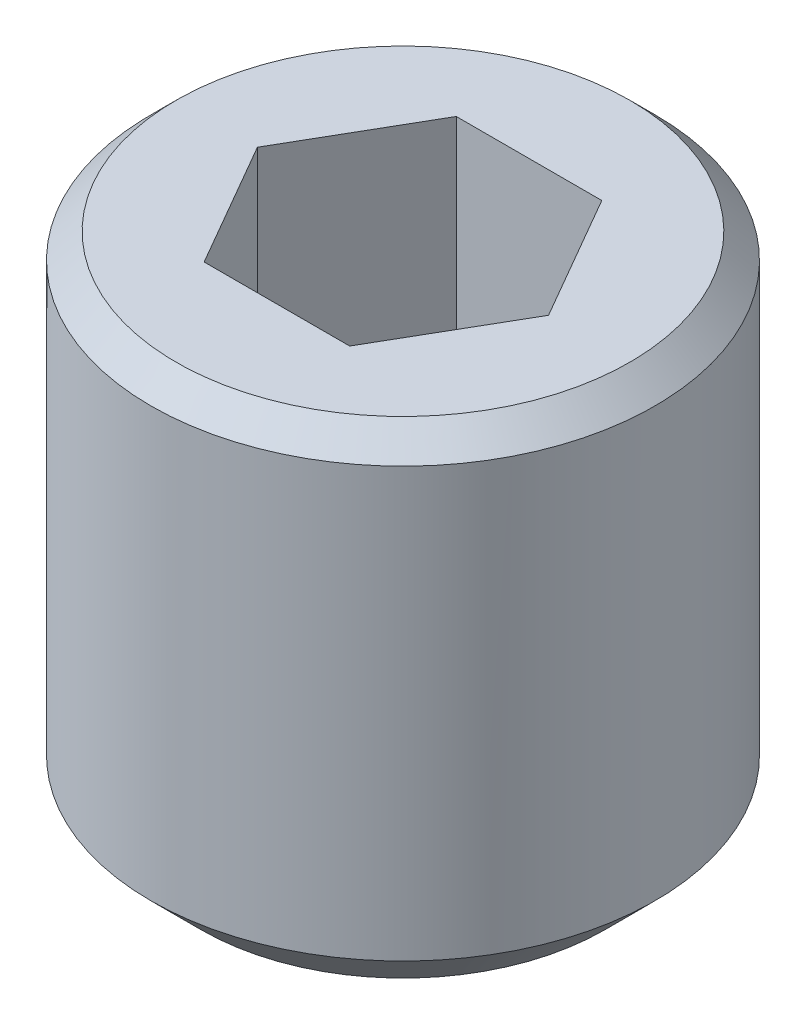
ISO-10303-21;
HEADER;
FILE_DESCRIPTION(('STEP AP214'),'2;1');
FILE_NAME('part.step','',(''),(''),'','','');
FILE_SCHEMA(('AUTOMOTIVE_DESIGN { 1 0 10303 214 1 1 1 1 }'));
ENDSEC;
DATA;
#1=APPLICATION_CONTEXT('core data for automotive mechanical design processes');
#2=APPLICATION_PROTOCOL_DEFINITION('international standard','automotive_design',2000,#1);
#3=PRODUCT_CONTEXT('',#1,'mechanical');
#4=PRODUCT('Part','Part','',(#3));
#5=PRODUCT_RELATED_PRODUCT_CATEGORY('part','',(#4));
#6=PRODUCT_DEFINITION_FORMATION('','',#4);
#7=PRODUCT_DEFINITION_CONTEXT('part definition',#1,'design');
#8=PRODUCT_DEFINITION('design','',#6,#7);
#9=PRODUCT_DEFINITION_SHAPE('','',#8);
#10=(LENGTH_UNIT() NAMED_UNIT(*) SI_UNIT(.MILLI.,.METRE.));
#11=(NAMED_UNIT(*) PLANE_ANGLE_UNIT() SI_UNIT($,.RADIAN.));
#12=(NAMED_UNIT(*) SI_UNIT($,.STERADIAN.) SOLID_ANGLE_UNIT());
#13=UNCERTAINTY_MEASURE_WITH_UNIT(LENGTH_MEASURE(1.E-05),#10,'distance_accuracy_value','');
#14=(GEOMETRIC_REPRESENTATION_CONTEXT(3) GLOBAL_UNCERTAINTY_ASSIGNED_CONTEXT((#13)) GLOBAL_UNIT_ASSIGNED_CONTEXT((#10,
#11,#12)) REPRESENTATION_CONTEXT('',''));
#15=CARTESIAN_POINT('',(0.,0.,0.));
#16=DIRECTION('',(0.,0.,1.));
#17=DIRECTION('',(1.,0.,0.));
#18=AXIS2_PLACEMENT_3D('',#15,#16,#17);
#19=CARTESIAN_POINT('',(0.,0.,0.));
#20=DIRECTION('',(0.,-1.,0.));
#21=DIRECTION('',(0.,0.,-1.));
#22=AXIS2_PLACEMENT_3D('',#19,#20,#21);
#23=PLANE('',#22);
#24=CARTESIAN_POINT('',(0.,0.,0.));
#25=DIRECTION('',(0.,-1.,0.));
#26=DIRECTION('',(0.,0.,-1.));
#27=AXIS2_PLACEMENT_3D('',#24,#25,#26);
#28=CIRCLE('',#27,1.35);
#29=CARTESIAN_POINT('',(0.,0.,-1.35));
#30=VERTEX_POINT('',#29);
#31=EDGE_CURVE('E44',#30,#30,#28,.F.);
#32=ORIENTED_EDGE('',*,*,#31,.T.);
#33=EDGE_LOOP('',(#32));
#34=FACE_BOUND('',#33,.T.);
#35=DIRECTION('',(-0.5,0.,0.866025403784439));
#36=VECTOR('',#35,1.);
#37=CARTESIAN_POINT('',(-0.43301270189222,0.,-0.75));
#38=LINE('',#37,#36);
#39=CARTESIAN_POINT('',(-0.43301270189222,0.,-0.75));
#40=VERTEX_POINT('',#39);
#41=CARTESIAN_POINT('',(-0.866025403784439,0.,0.));
#42=VERTEX_POINT('',#41);
#43=EDGE_CURVE('E125',#40,#42,#38,.T.);
#44=ORIENTED_EDGE('',*,*,#43,.F.);
#45=DIRECTION('',(-1.,0.,0.));
#46=VECTOR('',#45,1.);
#47=CARTESIAN_POINT('',(0.43301270189222,0.,-0.75));
#48=LINE('',#47,#46);
#49=CARTESIAN_POINT('',(0.43301270189222,0.,-0.75));
#50=VERTEX_POINT('',#49);
#51=EDGE_CURVE('E51',#50,#40,#48,.T.);
#52=ORIENTED_EDGE('',*,*,#51,.F.);
#53=DIRECTION('',(-0.5,0.,-0.866025403784439));
#54=VECTOR('',#53,1.);
#55=CARTESIAN_POINT('',(0.866025403784439,0.,0.));
#56=LINE('',#55,#54);
#57=CARTESIAN_POINT('',(0.866025403784439,0.,0.));
#58=VERTEX_POINT('',#57);
#59=EDGE_CURVE('E134',#58,#50,#56,.T.);
#60=ORIENTED_EDGE('',*,*,#59,.F.);
#61=DIRECTION('',(0.5,0.,-0.866025403784439));
#62=VECTOR('',#61,1.);
#63=CARTESIAN_POINT('',(0.43301270189222,0.,0.75));
#64=LINE('',#63,#62);
#65=CARTESIAN_POINT('',(0.43301270189222,0.,0.75));
#66=VERTEX_POINT('',#65);
#67=EDGE_CURVE('E132',#66,#58,#64,.T.);
#68=ORIENTED_EDGE('',*,*,#67,.F.);
#69=DIRECTION('',(1.,0.,0.));
#70=VECTOR('',#69,1.);
#71=CARTESIAN_POINT('',(-0.433012701892219,0.,0.750000000000001));
#72=LINE('',#71,#70);
#73=CARTESIAN_POINT('',(-0.433012701892219,0.,0.750000000000001));
#74=VERTEX_POINT('',#73);
#75=EDGE_CURVE('E99',#74,#66,#72,.T.);
#76=ORIENTED_EDGE('',*,*,#75,.F.);
#77=DIRECTION('',(0.5,0.,0.866025403784438));
#78=VECTOR('',#77,1.);
#79=CARTESIAN_POINT('',(-0.866025403784439,0.,0.));
#80=LINE('',#79,#78);
#81=EDGE_CURVE('E128',#42,#74,#80,.T.);
#82=ORIENTED_EDGE('',*,*,#81,.F.);
#83=EDGE_LOOP('',(#44,#52,#60,#68,#76,#82));
#84=FACE_BOUND('',#83,.T.);
#85=ADVANCED_FACE('F36',(#34,#84),#23,.F.);
#86=CARTESIAN_POINT('',(0.,0.,0.));
#87=DIRECTION('',(0.,1.,0.));
#88=DIRECTION('',(0.,0.,1.));
#89=AXIS2_PLACEMENT_3D('',#86,#87,#88);
#90=CYLINDRICAL_SURFACE('',#89,1.5);
#91=CARTESIAN_POINT('',(0.,-0.150000000000001,0.));
#92=DIRECTION('',(0.,-1.,0.));
#93=DIRECTION('',(0.,0.,-1.));
#94=AXIS2_PLACEMENT_3D('',#91,#92,#93);
#95=CIRCLE('',#94,1.5);
#96=CARTESIAN_POINT('',(0.,-0.150000000000001,-1.5));
#97=VERTEX_POINT('',#96);
#98=EDGE_CURVE('E11',#97,#97,#95,.T.);
#99=ORIENTED_EDGE('',*,*,#98,.T.);
#100=EDGE_LOOP('',(#99));
#101=FACE_BOUND('',#100,.T.);
#102=CARTESIAN_POINT('',(0.,-2.7,0.));
#103=DIRECTION('',(0.,1.,0.));
#104=DIRECTION('',(0.,0.,1.));
#105=AXIS2_PLACEMENT_3D('',#102,#103,#104);
#106=CIRCLE('',#105,1.5);
#107=CARTESIAN_POINT('',(0.,-2.7,1.5));
#108=VERTEX_POINT('',#107);
#109=EDGE_CURVE('E138',#108,#108,#106,.T.);
#110=ORIENTED_EDGE('',*,*,#109,.T.);
#111=EDGE_LOOP('',(#110));
#112=FACE_BOUND('',#111,.T.);
#113=ADVANCED_FACE('F162',(#101,#112),#90,.T.);
#114=CARTESIAN_POINT('',(1.5,-3.,0.));
#115=DIRECTION('',(0.,1.,0.));
#116=DIRECTION('',(0.,0.,1.));
#117=AXIS2_PLACEMENT_3D('',#114,#115,#116);
#118=PLANE('',#117);
#119=CARTESIAN_POINT('',(0.,-3.,0.));
#120=DIRECTION('',(0.,1.,0.));
#121=DIRECTION('',(0.,0.,1.));
#122=AXIS2_PLACEMENT_3D('',#119,#120,#121);
#123=CIRCLE('',#122,1.2);
#124=CARTESIAN_POINT('',(0.,-3.,1.2));
#125=VERTEX_POINT('',#124);
#126=EDGE_CURVE('E146',#125,#125,#123,.F.);
#127=ORIENTED_EDGE('',*,*,#126,.T.);
#128=EDGE_LOOP('',(#127));
#129=FACE_BOUND('',#128,.T.);
#130=ADVANCED_FACE('F167',(#129),#118,.F.);
#131=CARTESIAN_POINT('',(0.43301270189222,-1.5,-0.75));
#132=DIRECTION('',(0.,0.,-1.));
#133=DIRECTION('',(-1.,0.,0.));
#134=AXIS2_PLACEMENT_3D('',#131,#132,#133);
#135=PLANE('',#134);
#136=ORIENTED_EDGE('',*,*,#51,.T.);
#137=DIRECTION('',(0.,1.,0.));
#138=VECTOR('',#137,1.);
#139=CARTESIAN_POINT('',(-0.43301270189222,-1.5,-0.75));
#140=LINE('',#139,#138);
#141=CARTESIAN_POINT('',(-0.43301270189222,-1.5,-0.75));
#142=VERTEX_POINT('',#141);
#143=EDGE_CURVE('E81',#142,#40,#140,.T.);
#144=ORIENTED_EDGE('',*,*,#143,.F.);
#145=DIRECTION('',(-1.,0.,0.));
#146=VECTOR('',#145,1.);
#147=CARTESIAN_POINT('',(0.43301270189222,-1.5,-0.75));
#148=LINE('',#147,#146);
#149=CARTESIAN_POINT('',(0.43301270189222,-1.5,-0.75));
#150=VERTEX_POINT('',#149);
#151=EDGE_CURVE('E136',#150,#142,#148,.T.);
#152=ORIENTED_EDGE('',*,*,#151,.F.);
#153=DIRECTION('',(0.,1.,0.));
#154=VECTOR('',#153,1.);
#155=CARTESIAN_POINT('',(0.43301270189222,-1.5,-0.75));
#156=LINE('',#155,#154);
#157=EDGE_CURVE('E59',#150,#50,#156,.T.);
#158=ORIENTED_EDGE('',*,*,#157,.T.);
#159=EDGE_LOOP('',(#136,#144,#152,#158));
#160=FACE_BOUND('',#159,.T.);
#161=ADVANCED_FACE('F173',(#160),#135,.F.);
#162=CARTESIAN_POINT('',(0.866025403784439,-1.5,0.));
#163=DIRECTION('',(0.866025403784439,0.,-0.5));
#164=DIRECTION('',(-0.5,0.,-0.866025403784439));
#165=AXIS2_PLACEMENT_3D('',#162,#163,#164);
#166=PLANE('',#165);
#167=ORIENTED_EDGE('',*,*,#59,.T.);
#168=ORIENTED_EDGE('',*,*,#157,.F.);
#169=DIRECTION('',(-0.5,0.,-0.866025403784439));
#170=VECTOR('',#169,1.);
#171=CARTESIAN_POINT('',(0.866025403784439,-1.5,0.));
#172=LINE('',#171,#170);
#173=CARTESIAN_POINT('',(0.866025403784439,-1.5,0.));
#174=VERTEX_POINT('',#173);
#175=EDGE_CURVE('E111',#174,#150,#172,.T.);
#176=ORIENTED_EDGE('',*,*,#175,.F.);
#177=DIRECTION('',(0.,1.,0.));
#178=VECTOR('',#177,1.);
#179=CARTESIAN_POINT('',(0.866025403784439,-1.5,0.));
#180=LINE('',#179,#178);
#181=EDGE_CURVE('E103',#174,#58,#180,.T.);
#182=ORIENTED_EDGE('',*,*,#181,.T.);
#183=EDGE_LOOP('',(#167,#168,#176,#182));
#184=FACE_BOUND('',#183,.T.);
#185=ADVANCED_FACE('F177',(#184),#166,.F.);
#186=CARTESIAN_POINT('',(0.43301270189222,-1.5,0.75));
#187=DIRECTION('',(0.866025403784439,0.,0.5));
#188=DIRECTION('',(0.5,0.,-0.866025403784439));
#189=AXIS2_PLACEMENT_3D('',#186,#187,#188);
#190=PLANE('',#189);
#191=ORIENTED_EDGE('',*,*,#67,.T.);
#192=ORIENTED_EDGE('',*,*,#181,.F.);
#193=DIRECTION('',(0.5,0.,-0.866025403784439));
#194=VECTOR('',#193,1.);
#195=CARTESIAN_POINT('',(0.43301270189222,-1.5,0.75));
#196=LINE('',#195,#194);
#197=CARTESIAN_POINT('',(0.43301270189222,-1.5,0.75));
#198=VERTEX_POINT('',#197);
#199=EDGE_CURVE('E107',#198,#174,#196,.T.);
#200=ORIENTED_EDGE('',*,*,#199,.F.);
#201=DIRECTION('',(0.,1.,0.));
#202=VECTOR('',#201,1.);
#203=CARTESIAN_POINT('',(0.43301270189222,-1.5,0.75));
#204=LINE('',#203,#202);
#205=EDGE_CURVE('E92',#198,#66,#204,.T.);
#206=ORIENTED_EDGE('',*,*,#205,.T.);
#207=EDGE_LOOP('',(#191,#192,#200,#206));
#208=FACE_BOUND('',#207,.T.);
#209=ADVANCED_FACE('F108',(#208),#190,.F.);
#210=CARTESIAN_POINT('',(-0.433012701892219,-1.5,0.750000000000001));
#211=DIRECTION('',(0.,0.,1.));
#212=DIRECTION('',(1.,0.,0.));
#213=AXIS2_PLACEMENT_3D('',#210,#211,#212);
#214=PLANE('',#213);
#215=ORIENTED_EDGE('',*,*,#75,.T.);
#216=ORIENTED_EDGE('',*,*,#205,.F.);
#217=DIRECTION('',(1.,0.,0.));
#218=VECTOR('',#217,1.);
#219=CARTESIAN_POINT('',(-0.433012701892219,-1.5,0.750000000000001));
#220=LINE('',#219,#218);
#221=CARTESIAN_POINT('',(-0.433012701892219,-1.5,0.750000000000001));
#222=VERTEX_POINT('',#221);
#223=EDGE_CURVE('E96',#222,#198,#220,.T.);
#224=ORIENTED_EDGE('',*,*,#223,.F.);
#225=DIRECTION('',(0.,1.,0.));
#226=VECTOR('',#225,1.);
#227=CARTESIAN_POINT('',(-0.433012701892219,-1.5,0.750000000000001));
#228=LINE('',#227,#226);
#229=EDGE_CURVE('E104',#222,#74,#228,.T.);
#230=ORIENTED_EDGE('',*,*,#229,.T.);
#231=EDGE_LOOP('',(#215,#216,#224,#230));
#232=FACE_BOUND('',#231,.T.);
#233=ADVANCED_FACE('F94',(#232),#214,.F.);
#234=CARTESIAN_POINT('',(-0.866025403784439,-1.5,0.));
#235=DIRECTION('',(-0.866025403784438,0.,0.5));
#236=DIRECTION('',(0.5,0.,0.866025403784438));
#237=AXIS2_PLACEMENT_3D('',#234,#235,#236);
#238=PLANE('',#237);
#239=ORIENTED_EDGE('',*,*,#81,.T.);
#240=ORIENTED_EDGE('',*,*,#229,.F.);
#241=DIRECTION('',(0.5,0.,0.866025403784438));
#242=VECTOR('',#241,1.);
#243=CARTESIAN_POINT('',(-0.866025403784439,-1.5,0.));
#244=LINE('',#243,#242);
#245=CARTESIAN_POINT('',(-0.866025403784439,-1.5,0.));
#246=VERTEX_POINT('',#245);
#247=EDGE_CURVE('E117',#246,#222,#244,.T.);
#248=ORIENTED_EDGE('',*,*,#247,.F.);
#249=DIRECTION('',(0.,1.,0.));
#250=VECTOR('',#249,1.);
#251=CARTESIAN_POINT('',(-0.866025403784439,-1.5,0.));
#252=LINE('',#251,#250);
#253=EDGE_CURVE('E141',#246,#42,#252,.T.);
#254=ORIENTED_EDGE('',*,*,#253,.T.);
#255=EDGE_LOOP('',(#239,#240,#248,#254));
#256=FACE_BOUND('',#255,.T.);
#257=ADVANCED_FACE('F181',(#256),#238,.F.);
#258=CARTESIAN_POINT('',(-0.43301270189222,-1.5,-0.75));
#259=DIRECTION('',(-0.866025403784439,0.,-0.5));
#260=DIRECTION('',(-0.5,0.,0.866025403784439));
#261=AXIS2_PLACEMENT_3D('',#258,#259,#260);
#262=PLANE('',#261);
#263=ORIENTED_EDGE('',*,*,#43,.T.);
#264=ORIENTED_EDGE('',*,*,#253,.F.);
#265=DIRECTION('',(-0.5,0.,0.866025403784439));
#266=VECTOR('',#265,1.);
#267=CARTESIAN_POINT('',(-0.43301270189222,-1.5,-0.75));
#268=LINE('',#267,#266);
#269=EDGE_CURVE('E119',#142,#246,#268,.T.);
#270=ORIENTED_EDGE('',*,*,#269,.F.);
#271=ORIENTED_EDGE('',*,*,#143,.T.);
#272=EDGE_LOOP('',(#263,#264,#270,#271));
#273=FACE_BOUND('',#272,.T.);
#274=ADVANCED_FACE('F178',(#273),#262,.F.);
#275=CARTESIAN_POINT('',(-0.43301270189222,-1.5,-0.75));
#276=DIRECTION('',(0.,1.,0.));
#277=DIRECTION('',(0.,0.,1.));
#278=AXIS2_PLACEMENT_3D('',#275,#276,#277);
#279=PLANE('',#278);
#280=ORIENTED_EDGE('',*,*,#151,.T.);
#281=ORIENTED_EDGE('',*,*,#269,.T.);
#282=ORIENTED_EDGE('',*,*,#247,.T.);
#283=ORIENTED_EDGE('',*,*,#223,.T.);
#284=ORIENTED_EDGE('',*,*,#199,.T.);
#285=ORIENTED_EDGE('',*,*,#175,.T.);
#286=EDGE_LOOP('',(#280,#281,#282,#283,#284,#285));
#287=FACE_BOUND('',#286,.T.);
#288=ADVANCED_FACE('F114',(#287),#279,.T.);
#289=CARTESIAN_POINT('',(0.,-2.7,0.));
#290=DIRECTION('',(0.,1.,0.));
#291=DIRECTION('',(0.,0.,1.));
#292=AXIS2_PLACEMENT_3D('',#289,#290,#291);
#293=CONICAL_SURFACE('',#292,1.5,0.78539816339745);
#294=ORIENTED_EDGE('',*,*,#126,.F.);
#295=EDGE_LOOP('',(#294));
#296=FACE_BOUND('',#295,.T.);
#297=ORIENTED_EDGE('',*,*,#109,.F.);
#298=EDGE_LOOP('',(#297));
#299=FACE_BOUND('',#298,.T.);
#300=ADVANCED_FACE('F154',(#296,#299),#293,.T.);
#301=CARTESIAN_POINT('',(0.,0.,0.));
#302=DIRECTION('',(0.,-1.,0.));
#303=DIRECTION('',(0.,0.,-1.));
#304=AXIS2_PLACEMENT_3D('',#301,#302,#303);
#305=CONICAL_SURFACE('',#304,1.35,0.785398163397448);
#306=ORIENTED_EDGE('',*,*,#98,.F.);
#307=EDGE_LOOP('',(#306));
#308=FACE_BOUND('',#307,.T.);
#309=ORIENTED_EDGE('',*,*,#31,.F.);
#310=EDGE_LOOP('',(#309));
#311=FACE_BOUND('',#310,.T.);
#312=ADVANCED_FACE('F38',(#308,#311),#305,.T.);
#313=CLOSED_SHELL('',(#85,#113,#130,#161,#185,#209,#233,#257,#274,#288,#300,#312));
#314=MANIFOLD_SOLID_BREP('B2',#313);
#315=ADVANCED_BREP_SHAPE_REPRESENTATION('',(#18,#314),#14);
#316=SHAPE_DEFINITION_REPRESENTATION(#9,#315);
ENDSEC;
END-ISO-10303-21;
